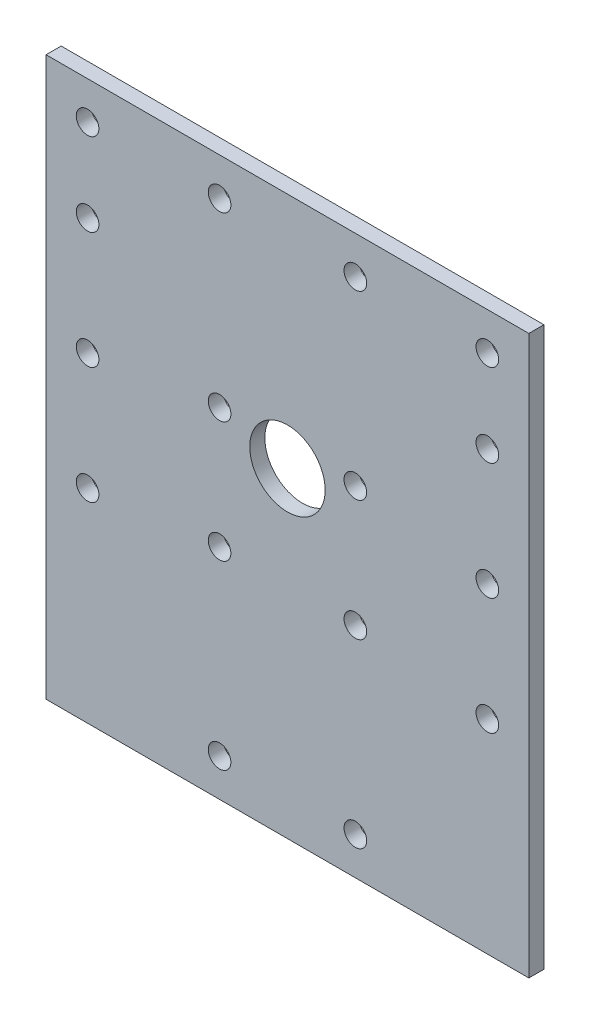
ISO-10303-21;
HEADER;
FILE_DESCRIPTION(('STEP AP214'),'2;1');
FILE_NAME('part.step','',(''),(''),'','','');
FILE_SCHEMA(('AUTOMOTIVE_DESIGN { 1 0 10303 214 1 1 1 1 }'));
ENDSEC;
DATA;
#1=APPLICATION_CONTEXT('core data for automotive mechanical design processes');
#2=APPLICATION_PROTOCOL_DEFINITION('international standard','automotive_design',2000,#1);
#3=PRODUCT_CONTEXT('',#1,'mechanical');
#4=PRODUCT('Part','Part','',(#3));
#5=PRODUCT_RELATED_PRODUCT_CATEGORY('part','',(#4));
#6=PRODUCT_DEFINITION_FORMATION('','',#4);
#7=PRODUCT_DEFINITION_CONTEXT('part definition',#1,'design');
#8=PRODUCT_DEFINITION('design','',#6,#7);
#9=PRODUCT_DEFINITION_SHAPE('','',#8);
#10=(LENGTH_UNIT() NAMED_UNIT(*) SI_UNIT(.MILLI.,.METRE.));
#11=(NAMED_UNIT(*) PLANE_ANGLE_UNIT() SI_UNIT($,.RADIAN.));
#12=(NAMED_UNIT(*) SI_UNIT($,.STERADIAN.) SOLID_ANGLE_UNIT());
#13=UNCERTAINTY_MEASURE_WITH_UNIT(LENGTH_MEASURE(1.E-05),#10,'distance_accuracy_value','');
#14=(GEOMETRIC_REPRESENTATION_CONTEXT(3) GLOBAL_UNCERTAINTY_ASSIGNED_CONTEXT((#13)) GLOBAL_UNIT_ASSIGNED_CONTEXT((#10,
#11,#12)) REPRESENTATION_CONTEXT('',''));
#15=CARTESIAN_POINT('',(0.,0.,0.));
#16=DIRECTION('',(0.,0.,1.));
#17=DIRECTION('',(1.,0.,0.));
#18=AXIS2_PLACEMENT_3D('',#15,#16,#17);
#19=CARTESIAN_POINT('',(32.0005499171305,37.,2.));
#20=DIRECTION('',(0.,0.,-1.));
#21=DIRECTION('',(-1.,0.,0.));
#22=AXIS2_PLACEMENT_3D('',#19,#20,#21);
#23=PLANE('',#22);
#24=CARTESIAN_POINT('',(-26.5,21.,2.));
#25=DIRECTION('',(0.,0.,1.));
#26=DIRECTION('',(-1.,0.,0.));
#27=AXIS2_PLACEMENT_3D('',#24,#25,#26);
#28=CIRCLE('',#27,1.50000000000001);
#29=CARTESIAN_POINT('',(-28.,21.,2.));
#30=VERTEX_POINT('',#29);
#31=EDGE_CURVE('E196',#30,#30,#28,.T.);
#32=ORIENTED_EDGE('',*,*,#31,.F.);
#33=EDGE_LOOP('',(#32));
#34=FACE_BOUND('',#33,.T.);
#35=CARTESIAN_POINT('',(-26.5,-10.,2.));
#36=DIRECTION('',(0.,0.,1.));
#37=DIRECTION('',(-1.,0.,0.));
#38=AXIS2_PLACEMENT_3D('',#35,#36,#37);
#39=CIRCLE('',#38,1.50000000000001);
#40=CARTESIAN_POINT('',(-28.,-10.,2.));
#41=VERTEX_POINT('',#40);
#42=EDGE_CURVE('E184',#41,#41,#39,.T.);
#43=ORIENTED_EDGE('',*,*,#42,.F.);
#44=EDGE_LOOP('',(#43));
#45=FACE_BOUND('',#44,.T.);
#46=CARTESIAN_POINT('',(9.00000000000001,-32.,2.));
#47=DIRECTION('',(0.,0.,1.));
#48=DIRECTION('',(-1.,0.,0.));
#49=AXIS2_PLACEMENT_3D('',#46,#47,#48);
#50=CIRCLE('',#49,1.5);
#51=CARTESIAN_POINT('',(7.50000000000001,-32.,2.));
#52=VERTEX_POINT('',#51);
#53=EDGE_CURVE('E172',#52,#52,#50,.T.);
#54=ORIENTED_EDGE('',*,*,#53,.F.);
#55=EDGE_LOOP('',(#54));
#56=FACE_BOUND('',#55,.T.);
#57=CARTESIAN_POINT('',(9.,8.,2.));
#58=DIRECTION('',(0.,0.,1.));
#59=DIRECTION('',(-1.,0.,0.));
#60=AXIS2_PLACEMENT_3D('',#57,#58,#59);
#61=CIRCLE('',#60,1.5);
#62=CARTESIAN_POINT('',(7.5,8.,2.));
#63=VERTEX_POINT('',#62);
#64=EDGE_CURVE('E160',#63,#63,#61,.T.);
#65=ORIENTED_EDGE('',*,*,#64,.F.);
#66=EDGE_LOOP('',(#65));
#67=FACE_BOUND('',#66,.T.);
#68=CARTESIAN_POINT('',(26.5,32.,2.));
#69=DIRECTION('',(0.,0.,1.));
#70=DIRECTION('',(1.,0.,0.));
#71=AXIS2_PLACEMENT_3D('',#68,#69,#70);
#72=CIRCLE('',#71,1.50000000000001);
#73=CARTESIAN_POINT('',(28.,32.,2.));
#74=VERTEX_POINT('',#73);
#75=EDGE_CURVE('E148',#74,#74,#72,.T.);
#76=ORIENTED_EDGE('',*,*,#75,.F.);
#77=EDGE_LOOP('',(#76));
#78=FACE_BOUND('',#77,.T.);
#79=CARTESIAN_POINT('',(-9.,-8.,2.));
#80=DIRECTION('',(0.,0.,1.));
#81=DIRECTION('',(1.,0.,0.));
#82=AXIS2_PLACEMENT_3D('',#79,#80,#81);
#83=CIRCLE('',#82,1.5);
#84=CARTESIAN_POINT('',(-7.5,-8.,2.));
#85=VERTEX_POINT('',#84);
#86=EDGE_CURVE('E136',#85,#85,#83,.T.);
#87=ORIENTED_EDGE('',*,*,#86,.F.);
#88=EDGE_LOOP('',(#87));
#89=FACE_BOUND('',#88,.T.);
#90=CARTESIAN_POINT('',(-9.,8.,2.));
#91=DIRECTION('',(0.,0.,1.));
#92=DIRECTION('',(1.,0.,0.));
#93=AXIS2_PLACEMENT_3D('',#90,#91,#92);
#94=CIRCLE('',#93,1.5);
#95=CARTESIAN_POINT('',(-7.5,8.,2.));
#96=VERTEX_POINT('',#95);
#97=EDGE_CURVE('E124',#96,#96,#94,.T.);
#98=ORIENTED_EDGE('',*,*,#97,.F.);
#99=EDGE_LOOP('',(#98));
#100=FACE_BOUND('',#99,.T.);
#101=CARTESIAN_POINT('',(-9.,32.,2.));
#102=DIRECTION('',(0.,0.,1.));
#103=DIRECTION('',(1.,0.,0.));
#104=AXIS2_PLACEMENT_3D('',#101,#102,#103);
#105=CIRCLE('',#104,1.5);
#106=CARTESIAN_POINT('',(-7.5,32.,2.));
#107=VERTEX_POINT('',#106);
#108=EDGE_CURVE('E112',#107,#107,#105,.T.);
#109=ORIENTED_EDGE('',*,*,#108,.F.);
#110=EDGE_LOOP('',(#109));
#111=FACE_BOUND('',#110,.T.);
#112=DIRECTION('',(0.,1.,0.));
#113=VECTOR('',#112,1.);
#114=CARTESIAN_POINT('',(32.0005499171305,-37.,2.));
#115=LINE('',#114,#113);
#116=CARTESIAN_POINT('',(32.0005499171305,-37.,2.));
#117=VERTEX_POINT('',#116);
#118=CARTESIAN_POINT('',(32.0005499171305,37.,2.));
#119=VERTEX_POINT('',#118);
#120=EDGE_CURVE('E82',#117,#119,#115,.T.);
#121=ORIENTED_EDGE('',*,*,#120,.T.);
#122=DIRECTION('',(-1.,0.,0.));
#123=VECTOR('',#122,1.);
#124=CARTESIAN_POINT('',(-32.0005499171305,37.,2.));
#125=LINE('',#124,#123);
#126=CARTESIAN_POINT('',(-32.0005499171305,37.,2.));
#127=VERTEX_POINT('',#126);
#128=EDGE_CURVE('E77',#119,#127,#125,.T.);
#129=ORIENTED_EDGE('',*,*,#128,.T.);
#130=DIRECTION('',(0.,-1.,0.));
#131=VECTOR('',#130,1.);
#132=CARTESIAN_POINT('',(-32.0005499171305,-37.,2.));
#133=LINE('',#132,#131);
#134=CARTESIAN_POINT('',(-32.0005499171305,-37.,2.));
#135=VERTEX_POINT('',#134);
#136=EDGE_CURVE('E80',#127,#135,#133,.T.);
#137=ORIENTED_EDGE('',*,*,#136,.T.);
#138=DIRECTION('',(1.,0.,0.));
#139=VECTOR('',#138,1.);
#140=CARTESIAN_POINT('',(-32.0005499171305,-37.,2.));
#141=LINE('',#140,#139);
#142=EDGE_CURVE('E47',#135,#117,#141,.T.);
#143=ORIENTED_EDGE('',*,*,#142,.T.);
#144=EDGE_LOOP('',(#121,#129,#137,#143));
#145=FACE_BOUND('',#144,.T.);
#146=CARTESIAN_POINT('',(26.5,-10.,2.));
#147=DIRECTION('',(0.,0.,1.));
#148=DIRECTION('',(1.,0.,0.));
#149=AXIS2_PLACEMENT_3D('',#146,#147,#148);
#150=CIRCLE('',#149,1.50000000000001);
#151=CARTESIAN_POINT('',(28.,-10.,2.));
#152=VERTEX_POINT('',#151);
#153=EDGE_CURVE('E97',#152,#152,#150,.T.);
#154=ORIENTED_EDGE('',*,*,#153,.F.);
#155=EDGE_LOOP('',(#154));
#156=FACE_BOUND('',#155,.T.);
#157=CARTESIAN_POINT('',(26.5,5.50000000000001,2.));
#158=DIRECTION('',(0.,0.,1.));
#159=DIRECTION('',(1.,0.,0.));
#160=AXIS2_PLACEMENT_3D('',#157,#158,#159);
#161=CIRCLE('',#160,1.50000000000001);
#162=CARTESIAN_POINT('',(28.,5.50000000000001,2.));
#163=VERTEX_POINT('',#162);
#164=EDGE_CURVE('E118',#163,#163,#161,.T.);
#165=ORIENTED_EDGE('',*,*,#164,.F.);
#166=EDGE_LOOP('',(#165));
#167=FACE_BOUND('',#166,.T.);
#168=CARTESIAN_POINT('',(-9.,-32.,2.));
#169=DIRECTION('',(0.,0.,1.));
#170=DIRECTION('',(1.,0.,0.));
#171=AXIS2_PLACEMENT_3D('',#168,#169,#170);
#172=CIRCLE('',#171,1.5);
#173=CARTESIAN_POINT('',(-7.5,-32.,2.));
#174=VERTEX_POINT('',#173);
#175=EDGE_CURVE('E130',#174,#174,#172,.T.);
#176=ORIENTED_EDGE('',*,*,#175,.F.);
#177=EDGE_LOOP('',(#176));
#178=FACE_BOUND('',#177,.T.);
#179=CARTESIAN_POINT('',(26.5,21.,2.));
#180=DIRECTION('',(0.,0.,1.));
#181=DIRECTION('',(1.,0.,0.));
#182=AXIS2_PLACEMENT_3D('',#179,#180,#181);
#183=CIRCLE('',#182,1.50000000000001);
#184=CARTESIAN_POINT('',(28.,21.,2.));
#185=VERTEX_POINT('',#184);
#186=EDGE_CURVE('E142',#185,#185,#183,.T.);
#187=ORIENTED_EDGE('',*,*,#186,.F.);
#188=EDGE_LOOP('',(#187));
#189=FACE_BOUND('',#188,.T.);
#190=CARTESIAN_POINT('',(8.99999999999999,32.,2.));
#191=DIRECTION('',(0.,0.,1.));
#192=DIRECTION('',(-1.,0.,0.));
#193=AXIS2_PLACEMENT_3D('',#190,#191,#192);
#194=CIRCLE('',#193,1.5);
#195=CARTESIAN_POINT('',(7.49999999999999,32.,2.));
#196=VERTEX_POINT('',#195);
#197=EDGE_CURVE('E154',#196,#196,#194,.T.);
#198=ORIENTED_EDGE('',*,*,#197,.F.);
#199=EDGE_LOOP('',(#198));
#200=FACE_BOUND('',#199,.T.);
#201=CARTESIAN_POINT('',(9.00000000000001,-8.,2.));
#202=DIRECTION('',(0.,0.,1.));
#203=DIRECTION('',(-1.,0.,0.));
#204=AXIS2_PLACEMENT_3D('',#201,#202,#203);
#205=CIRCLE('',#204,1.5);
#206=CARTESIAN_POINT('',(7.50000000000001,-8.,2.));
#207=VERTEX_POINT('',#206);
#208=EDGE_CURVE('E166',#207,#207,#205,.T.);
#209=ORIENTED_EDGE('',*,*,#208,.F.);
#210=EDGE_LOOP('',(#209));
#211=FACE_BOUND('',#210,.T.);
#212=CARTESIAN_POINT('',(0.,5.5,2.));
#213=DIRECTION('',(0.,0.,1.));
#214=DIRECTION('',(1.,0.,0.));
#215=AXIS2_PLACEMENT_3D('',#212,#213,#214);
#216=CIRCLE('',#215,5.);
#217=CARTESIAN_POINT('',(5.,5.5,2.));
#218=VERTEX_POINT('',#217);
#219=EDGE_CURVE('E178',#218,#218,#216,.T.);
#220=ORIENTED_EDGE('',*,*,#219,.F.);
#221=EDGE_LOOP('',(#220));
#222=FACE_BOUND('',#221,.T.);
#223=CARTESIAN_POINT('',(-26.5,5.50000000000001,2.));
#224=DIRECTION('',(0.,0.,1.));
#225=DIRECTION('',(-1.,0.,0.));
#226=AXIS2_PLACEMENT_3D('',#223,#224,#225);
#227=CIRCLE('',#226,1.50000000000001);
#228=CARTESIAN_POINT('',(-28.,5.50000000000001,2.));
#229=VERTEX_POINT('',#228);
#230=EDGE_CURVE('E190',#229,#229,#227,.T.);
#231=ORIENTED_EDGE('',*,*,#230,.F.);
#232=EDGE_LOOP('',(#231));
#233=FACE_BOUND('',#232,.T.);
#234=CARTESIAN_POINT('',(-26.5,32.,2.));
#235=DIRECTION('',(0.,0.,1.));
#236=DIRECTION('',(-1.,0.,0.));
#237=AXIS2_PLACEMENT_3D('',#234,#235,#236);
#238=CIRCLE('',#237,1.50000000000001);
#239=CARTESIAN_POINT('',(-28.,32.,2.));
#240=VERTEX_POINT('',#239);
#241=EDGE_CURVE('E202',#240,#240,#238,.T.);
#242=ORIENTED_EDGE('',*,*,#241,.F.);
#243=EDGE_LOOP('',(#242));
#244=FACE_BOUND('',#243,.T.);
#245=ADVANCED_FACE('F30',(#34,#45,#56,#67,#78,#89,#100,#111,#145,#156,#167,#178,#189,#200,#211,
#222,#233,#244),#23,.F.);
#246=CARTESIAN_POINT('',(32.0005499171305,37.,0.));
#247=DIRECTION('',(0.,0.,-1.));
#248=DIRECTION('',(-1.,0.,0.));
#249=AXIS2_PLACEMENT_3D('',#246,#247,#248);
#250=PLANE('',#249);
#251=CARTESIAN_POINT('',(-26.5,21.,0.));
#252=DIRECTION('',(0.,0.,1.));
#253=DIRECTION('',(-1.,0.,0.));
#254=AXIS2_PLACEMENT_3D('',#251,#252,#253);
#255=CIRCLE('',#254,1.50000000000001);
#256=CARTESIAN_POINT('',(-28.,21.,0.));
#257=VERTEX_POINT('',#256);
#258=EDGE_CURVE('E199',#257,#257,#255,.T.);
#259=ORIENTED_EDGE('',*,*,#258,.T.);
#260=EDGE_LOOP('',(#259));
#261=FACE_BOUND('',#260,.T.);
#262=CARTESIAN_POINT('',(-26.5,-10.,0.));
#263=DIRECTION('',(0.,0.,1.));
#264=DIRECTION('',(-1.,0.,0.));
#265=AXIS2_PLACEMENT_3D('',#262,#263,#264);
#266=CIRCLE('',#265,1.50000000000001);
#267=CARTESIAN_POINT('',(-28.,-10.,0.));
#268=VERTEX_POINT('',#267);
#269=EDGE_CURVE('E187',#268,#268,#266,.T.);
#270=ORIENTED_EDGE('',*,*,#269,.T.);
#271=EDGE_LOOP('',(#270));
#272=FACE_BOUND('',#271,.T.);
#273=CARTESIAN_POINT('',(9.00000000000001,-32.,0.));
#274=DIRECTION('',(0.,0.,1.));
#275=DIRECTION('',(-1.,0.,0.));
#276=AXIS2_PLACEMENT_3D('',#273,#274,#275);
#277=CIRCLE('',#276,1.5);
#278=CARTESIAN_POINT('',(7.50000000000001,-32.,0.));
#279=VERTEX_POINT('',#278);
#280=EDGE_CURVE('E175',#279,#279,#277,.T.);
#281=ORIENTED_EDGE('',*,*,#280,.T.);
#282=EDGE_LOOP('',(#281));
#283=FACE_BOUND('',#282,.T.);
#284=CARTESIAN_POINT('',(9.,8.,0.));
#285=DIRECTION('',(0.,0.,1.));
#286=DIRECTION('',(-1.,0.,0.));
#287=AXIS2_PLACEMENT_3D('',#284,#285,#286);
#288=CIRCLE('',#287,1.5);
#289=CARTESIAN_POINT('',(7.5,8.,0.));
#290=VERTEX_POINT('',#289);
#291=EDGE_CURVE('E163',#290,#290,#288,.T.);
#292=ORIENTED_EDGE('',*,*,#291,.T.);
#293=EDGE_LOOP('',(#292));
#294=FACE_BOUND('',#293,.T.);
#295=CARTESIAN_POINT('',(26.5,32.,0.));
#296=DIRECTION('',(0.,0.,1.));
#297=DIRECTION('',(1.,0.,0.));
#298=AXIS2_PLACEMENT_3D('',#295,#296,#297);
#299=CIRCLE('',#298,1.50000000000001);
#300=CARTESIAN_POINT('',(28.,32.,0.));
#301=VERTEX_POINT('',#300);
#302=EDGE_CURVE('E151',#301,#301,#299,.T.);
#303=ORIENTED_EDGE('',*,*,#302,.T.);
#304=EDGE_LOOP('',(#303));
#305=FACE_BOUND('',#304,.T.);
#306=CARTESIAN_POINT('',(-9.,-8.,0.));
#307=DIRECTION('',(0.,0.,1.));
#308=DIRECTION('',(1.,0.,0.));
#309=AXIS2_PLACEMENT_3D('',#306,#307,#308);
#310=CIRCLE('',#309,1.5);
#311=CARTESIAN_POINT('',(-7.5,-8.,0.));
#312=VERTEX_POINT('',#311);
#313=EDGE_CURVE('E139',#312,#312,#310,.T.);
#314=ORIENTED_EDGE('',*,*,#313,.T.);
#315=EDGE_LOOP('',(#314));
#316=FACE_BOUND('',#315,.T.);
#317=CARTESIAN_POINT('',(-9.,8.,0.));
#318=DIRECTION('',(0.,0.,1.));
#319=DIRECTION('',(1.,0.,0.));
#320=AXIS2_PLACEMENT_3D('',#317,#318,#319);
#321=CIRCLE('',#320,1.5);
#322=CARTESIAN_POINT('',(-7.5,8.,0.));
#323=VERTEX_POINT('',#322);
#324=EDGE_CURVE('E127',#323,#323,#321,.T.);
#325=ORIENTED_EDGE('',*,*,#324,.T.);
#326=EDGE_LOOP('',(#325));
#327=FACE_BOUND('',#326,.T.);
#328=CARTESIAN_POINT('',(-9.,32.,0.));
#329=DIRECTION('',(0.,0.,1.));
#330=DIRECTION('',(1.,0.,0.));
#331=AXIS2_PLACEMENT_3D('',#328,#329,#330);
#332=CIRCLE('',#331,1.5);
#333=CARTESIAN_POINT('',(-7.5,32.,0.));
#334=VERTEX_POINT('',#333);
#335=EDGE_CURVE('E115',#334,#334,#332,.T.);
#336=ORIENTED_EDGE('',*,*,#335,.T.);
#337=EDGE_LOOP('',(#336));
#338=FACE_BOUND('',#337,.T.);
#339=DIRECTION('',(0.,1.,0.));
#340=VECTOR('',#339,1.);
#341=CARTESIAN_POINT('',(32.0005499171305,-37.,0.));
#342=LINE('',#341,#340);
#343=CARTESIAN_POINT('',(32.0005499171305,-37.,0.));
#344=VERTEX_POINT('',#343);
#345=CARTESIAN_POINT('',(32.0005499171305,37.,0.));
#346=VERTEX_POINT('',#345);
#347=EDGE_CURVE('E94',#344,#346,#342,.T.);
#348=ORIENTED_EDGE('',*,*,#347,.F.);
#349=DIRECTION('',(1.,0.,0.));
#350=VECTOR('',#349,1.);
#351=CARTESIAN_POINT('',(-32.0005499171305,-37.,0.));
#352=LINE('',#351,#350);
#353=CARTESIAN_POINT('',(-32.0005499171305,-37.,0.));
#354=VERTEX_POINT('',#353);
#355=EDGE_CURVE('E70',#354,#344,#352,.T.);
#356=ORIENTED_EDGE('',*,*,#355,.F.);
#357=DIRECTION('',(0.,-1.,0.));
#358=VECTOR('',#357,1.);
#359=CARTESIAN_POINT('',(-32.0005499171305,-37.,0.));
#360=LINE('',#359,#358);
#361=CARTESIAN_POINT('',(-32.0005499171305,37.,0.));
#362=VERTEX_POINT('',#361);
#363=EDGE_CURVE('E64',#362,#354,#360,.T.);
#364=ORIENTED_EDGE('',*,*,#363,.F.);
#365=DIRECTION('',(-1.,0.,0.));
#366=VECTOR('',#365,1.);
#367=CARTESIAN_POINT('',(-32.0005499171305,37.,0.));
#368=LINE('',#367,#366);
#369=EDGE_CURVE('E86',#346,#362,#368,.T.);
#370=ORIENTED_EDGE('',*,*,#369,.F.);
#371=EDGE_LOOP('',(#348,#356,#364,#370));
#372=FACE_BOUND('',#371,.T.);
#373=CARTESIAN_POINT('',(26.5,-10.,0.));
#374=DIRECTION('',(0.,0.,1.));
#375=DIRECTION('',(1.,0.,0.));
#376=AXIS2_PLACEMENT_3D('',#373,#374,#375);
#377=CIRCLE('',#376,1.50000000000001);
#378=CARTESIAN_POINT('',(28.,-10.,0.));
#379=VERTEX_POINT('',#378);
#380=EDGE_CURVE('E109',#379,#379,#377,.T.);
#381=ORIENTED_EDGE('',*,*,#380,.T.);
#382=EDGE_LOOP('',(#381));
#383=FACE_BOUND('',#382,.T.);
#384=CARTESIAN_POINT('',(26.5,5.50000000000001,0.));
#385=DIRECTION('',(0.,0.,1.));
#386=DIRECTION('',(1.,0.,0.));
#387=AXIS2_PLACEMENT_3D('',#384,#385,#386);
#388=CIRCLE('',#387,1.50000000000001);
#389=CARTESIAN_POINT('',(28.,5.50000000000001,0.));
#390=VERTEX_POINT('',#389);
#391=EDGE_CURVE('E121',#390,#390,#388,.T.);
#392=ORIENTED_EDGE('',*,*,#391,.T.);
#393=EDGE_LOOP('',(#392));
#394=FACE_BOUND('',#393,.T.);
#395=CARTESIAN_POINT('',(-9.,-32.,0.));
#396=DIRECTION('',(0.,0.,1.));
#397=DIRECTION('',(1.,0.,0.));
#398=AXIS2_PLACEMENT_3D('',#395,#396,#397);
#399=CIRCLE('',#398,1.5);
#400=CARTESIAN_POINT('',(-7.5,-32.,0.));
#401=VERTEX_POINT('',#400);
#402=EDGE_CURVE('E133',#401,#401,#399,.T.);
#403=ORIENTED_EDGE('',*,*,#402,.T.);
#404=EDGE_LOOP('',(#403));
#405=FACE_BOUND('',#404,.T.);
#406=CARTESIAN_POINT('',(26.5,21.,0.));
#407=DIRECTION('',(0.,0.,1.));
#408=DIRECTION('',(1.,0.,0.));
#409=AXIS2_PLACEMENT_3D('',#406,#407,#408);
#410=CIRCLE('',#409,1.50000000000001);
#411=CARTESIAN_POINT('',(28.,21.,0.));
#412=VERTEX_POINT('',#411);
#413=EDGE_CURVE('E145',#412,#412,#410,.T.);
#414=ORIENTED_EDGE('',*,*,#413,.T.);
#415=EDGE_LOOP('',(#414));
#416=FACE_BOUND('',#415,.T.);
#417=CARTESIAN_POINT('',(8.99999999999999,32.,0.));
#418=DIRECTION('',(0.,0.,1.));
#419=DIRECTION('',(-1.,0.,0.));
#420=AXIS2_PLACEMENT_3D('',#417,#418,#419);
#421=CIRCLE('',#420,1.5);
#422=CARTESIAN_POINT('',(7.49999999999999,32.,0.));
#423=VERTEX_POINT('',#422);
#424=EDGE_CURVE('E157',#423,#423,#421,.T.);
#425=ORIENTED_EDGE('',*,*,#424,.T.);
#426=EDGE_LOOP('',(#425));
#427=FACE_BOUND('',#426,.T.);
#428=CARTESIAN_POINT('',(9.00000000000001,-8.,0.));
#429=DIRECTION('',(0.,0.,1.));
#430=DIRECTION('',(-1.,0.,0.));
#431=AXIS2_PLACEMENT_3D('',#428,#429,#430);
#432=CIRCLE('',#431,1.5);
#433=CARTESIAN_POINT('',(7.50000000000001,-8.,0.));
#434=VERTEX_POINT('',#433);
#435=EDGE_CURVE('E169',#434,#434,#432,.T.);
#436=ORIENTED_EDGE('',*,*,#435,.T.);
#437=EDGE_LOOP('',(#436));
#438=FACE_BOUND('',#437,.T.);
#439=CARTESIAN_POINT('',(0.,5.5,0.));
#440=DIRECTION('',(0.,0.,1.));
#441=DIRECTION('',(1.,0.,0.));
#442=AXIS2_PLACEMENT_3D('',#439,#440,#441);
#443=CIRCLE('',#442,5.);
#444=CARTESIAN_POINT('',(5.,5.5,0.));
#445=VERTEX_POINT('',#444);
#446=EDGE_CURVE('E181',#445,#445,#443,.T.);
#447=ORIENTED_EDGE('',*,*,#446,.T.);
#448=EDGE_LOOP('',(#447));
#449=FACE_BOUND('',#448,.T.);
#450=CARTESIAN_POINT('',(-26.5,5.50000000000001,0.));
#451=DIRECTION('',(0.,0.,1.));
#452=DIRECTION('',(-1.,0.,0.));
#453=AXIS2_PLACEMENT_3D('',#450,#451,#452);
#454=CIRCLE('',#453,1.50000000000001);
#455=CARTESIAN_POINT('',(-28.,5.50000000000001,0.));
#456=VERTEX_POINT('',#455);
#457=EDGE_CURVE('E193',#456,#456,#454,.T.);
#458=ORIENTED_EDGE('',*,*,#457,.T.);
#459=EDGE_LOOP('',(#458));
#460=FACE_BOUND('',#459,.T.);
#461=CARTESIAN_POINT('',(-26.5,32.,0.));
#462=DIRECTION('',(0.,0.,1.));
#463=DIRECTION('',(-1.,0.,0.));
#464=AXIS2_PLACEMENT_3D('',#461,#462,#463);
#465=CIRCLE('',#464,1.50000000000001);
#466=CARTESIAN_POINT('',(-28.,32.,0.));
#467=VERTEX_POINT('',#466);
#468=EDGE_CURVE('E205',#467,#467,#465,.T.);
#469=ORIENTED_EDGE('',*,*,#468,.T.);
#470=EDGE_LOOP('',(#469));
#471=FACE_BOUND('',#470,.T.);
#472=ADVANCED_FACE('F105',(#261,#272,#283,#294,#305,#316,#327,#338,#372,#383,#394,#405,#416,
#427,#438,#449,#460,#471),#250,.T.);
#473=CARTESIAN_POINT('',(32.0005499171305,-37.,2.));
#474=DIRECTION('',(-1.,0.,0.));
#475=DIRECTION('',(0.,0.,1.));
#476=AXIS2_PLACEMENT_3D('',#473,#474,#475);
#477=PLANE('',#476);
#478=ORIENTED_EDGE('',*,*,#347,.T.);
#479=DIRECTION('',(0.,0.,-1.));
#480=VECTOR('',#479,1.);
#481=CARTESIAN_POINT('',(32.0005499171305,37.,2.));
#482=LINE('',#481,#480);
#483=EDGE_CURVE('E11',#119,#346,#482,.T.);
#484=ORIENTED_EDGE('',*,*,#483,.F.);
#485=ORIENTED_EDGE('',*,*,#120,.F.);
#486=DIRECTION('',(0.,0.,-1.));
#487=VECTOR('',#486,1.);
#488=CARTESIAN_POINT('',(32.0005499171305,-37.,2.));
#489=LINE('',#488,#487);
#490=EDGE_CURVE('E90',#117,#344,#489,.T.);
#491=ORIENTED_EDGE('',*,*,#490,.T.);
#492=EDGE_LOOP('',(#478,#484,#485,#491));
#493=FACE_BOUND('',#492,.T.);
#494=ADVANCED_FACE('F32',(#493),#477,.F.);
#495=CARTESIAN_POINT('',(-32.0005499171305,37.,2.));
#496=DIRECTION('',(0.,-1.,0.));
#497=DIRECTION('',(0.,0.,-1.));
#498=AXIS2_PLACEMENT_3D('',#495,#496,#497);
#499=PLANE('',#498);
#500=ORIENTED_EDGE('',*,*,#369,.T.);
#501=DIRECTION('',(0.,0.,-1.));
#502=VECTOR('',#501,1.);
#503=CARTESIAN_POINT('',(-32.0005499171305,37.,2.));
#504=LINE('',#503,#502);
#505=EDGE_CURVE('E39',#127,#362,#504,.T.);
#506=ORIENTED_EDGE('',*,*,#505,.F.);
#507=ORIENTED_EDGE('',*,*,#128,.F.);
#508=ORIENTED_EDGE('',*,*,#483,.T.);
#509=EDGE_LOOP('',(#500,#506,#507,#508));
#510=FACE_BOUND('',#509,.T.);
#511=ADVANCED_FACE('F85',(#510),#499,.F.);
#512=CARTESIAN_POINT('',(-32.0005499171305,-37.,2.));
#513=DIRECTION('',(1.,0.,0.));
#514=DIRECTION('',(0.,0.,-1.));
#515=AXIS2_PLACEMENT_3D('',#512,#513,#514);
#516=PLANE('',#515);
#517=ORIENTED_EDGE('',*,*,#363,.T.);
#518=DIRECTION('',(0.,0.,-1.));
#519=VECTOR('',#518,1.);
#520=CARTESIAN_POINT('',(-32.0005499171305,-37.,2.));
#521=LINE('',#520,#519);
#522=EDGE_CURVE('E87',#135,#354,#521,.T.);
#523=ORIENTED_EDGE('',*,*,#522,.F.);
#524=ORIENTED_EDGE('',*,*,#136,.F.);
#525=ORIENTED_EDGE('',*,*,#505,.T.);
#526=EDGE_LOOP('',(#517,#523,#524,#525));
#527=FACE_BOUND('',#526,.T.);
#528=ADVANCED_FACE('F88',(#527),#516,.F.);
#529=CARTESIAN_POINT('',(-32.0005499171305,-37.,2.));
#530=DIRECTION('',(0.,1.,0.));
#531=DIRECTION('',(0.,0.,1.));
#532=AXIS2_PLACEMENT_3D('',#529,#530,#531);
#533=PLANE('',#532);
#534=ORIENTED_EDGE('',*,*,#355,.T.);
#535=ORIENTED_EDGE('',*,*,#490,.F.);
#536=ORIENTED_EDGE('',*,*,#142,.F.);
#537=ORIENTED_EDGE('',*,*,#522,.T.);
#538=EDGE_LOOP('',(#534,#535,#536,#537));
#539=FACE_BOUND('',#538,.T.);
#540=ADVANCED_FACE('F102',(#539),#533,.F.);
#541=CARTESIAN_POINT('',(26.5,-10.,2.));
#542=DIRECTION('',(0.,0.,-1.));
#543=DIRECTION('',(-1.,0.,0.));
#544=AXIS2_PLACEMENT_3D('',#541,#542,#543);
#545=CYLINDRICAL_SURFACE('',#544,1.50000000000001);
#546=ORIENTED_EDGE('',*,*,#153,.T.);
#547=EDGE_LOOP('',(#546));
#548=FACE_BOUND('',#547,.T.);
#549=ORIENTED_EDGE('',*,*,#380,.F.);
#550=EDGE_LOOP('',(#549));
#551=FACE_BOUND('',#550,.T.);
#552=ADVANCED_FACE('F225',(#548,#551),#545,.F.);
#553=CARTESIAN_POINT('',(-9.,32.,2.));
#554=DIRECTION('',(0.,0.,-1.));
#555=DIRECTION('',(-1.,0.,0.));
#556=AXIS2_PLACEMENT_3D('',#553,#554,#555);
#557=CYLINDRICAL_SURFACE('',#556,1.5);
#558=ORIENTED_EDGE('',*,*,#108,.T.);
#559=EDGE_LOOP('',(#558));
#560=FACE_BOUND('',#559,.T.);
#561=ORIENTED_EDGE('',*,*,#335,.F.);
#562=EDGE_LOOP('',(#561));
#563=FACE_BOUND('',#562,.T.);
#564=ADVANCED_FACE('F271',(#560,#563),#557,.F.);
#565=CARTESIAN_POINT('',(26.5,5.50000000000001,2.));
#566=DIRECTION('',(0.,0.,-1.));
#567=DIRECTION('',(-1.,0.,0.));
#568=AXIS2_PLACEMENT_3D('',#565,#566,#567);
#569=CYLINDRICAL_SURFACE('',#568,1.50000000000001);
#570=ORIENTED_EDGE('',*,*,#164,.T.);
#571=EDGE_LOOP('',(#570));
#572=FACE_BOUND('',#571,.T.);
#573=ORIENTED_EDGE('',*,*,#391,.F.);
#574=EDGE_LOOP('',(#573));
#575=FACE_BOUND('',#574,.T.);
#576=ADVANCED_FACE('F279',(#572,#575),#569,.F.);
#577=CARTESIAN_POINT('',(-9.,8.,2.));
#578=DIRECTION('',(0.,0.,-1.));
#579=DIRECTION('',(-1.,0.,0.));
#580=AXIS2_PLACEMENT_3D('',#577,#578,#579);
#581=CYLINDRICAL_SURFACE('',#580,1.5);
#582=ORIENTED_EDGE('',*,*,#97,.T.);
#583=EDGE_LOOP('',(#582));
#584=FACE_BOUND('',#583,.T.);
#585=ORIENTED_EDGE('',*,*,#324,.F.);
#586=EDGE_LOOP('',(#585));
#587=FACE_BOUND('',#586,.T.);
#588=ADVANCED_FACE('F287',(#584,#587),#581,.F.);
#589=CARTESIAN_POINT('',(-9.,-32.,2.));
#590=DIRECTION('',(0.,0.,-1.));
#591=DIRECTION('',(-1.,0.,0.));
#592=AXIS2_PLACEMENT_3D('',#589,#590,#591);
#593=CYLINDRICAL_SURFACE('',#592,1.5);
#594=ORIENTED_EDGE('',*,*,#175,.T.);
#595=EDGE_LOOP('',(#594));
#596=FACE_BOUND('',#595,.T.);
#597=ORIENTED_EDGE('',*,*,#402,.F.);
#598=EDGE_LOOP('',(#597));
#599=FACE_BOUND('',#598,.T.);
#600=ADVANCED_FACE('F296',(#596,#599),#593,.F.);
#601=CARTESIAN_POINT('',(-9.,-8.,2.));
#602=DIRECTION('',(0.,0.,-1.));
#603=DIRECTION('',(-1.,0.,0.));
#604=AXIS2_PLACEMENT_3D('',#601,#602,#603);
#605=CYLINDRICAL_SURFACE('',#604,1.5);
#606=ORIENTED_EDGE('',*,*,#86,.T.);
#607=EDGE_LOOP('',(#606));
#608=FACE_BOUND('',#607,.T.);
#609=ORIENTED_EDGE('',*,*,#313,.F.);
#610=EDGE_LOOP('',(#609));
#611=FACE_BOUND('',#610,.T.);
#612=ADVANCED_FACE('F305',(#608,#611),#605,.F.);
#613=CARTESIAN_POINT('',(26.5,21.,2.));
#614=DIRECTION('',(0.,0.,-1.));
#615=DIRECTION('',(-1.,0.,0.));
#616=AXIS2_PLACEMENT_3D('',#613,#614,#615);
#617=CYLINDRICAL_SURFACE('',#616,1.50000000000001);
#618=ORIENTED_EDGE('',*,*,#186,.T.);
#619=EDGE_LOOP('',(#618));
#620=FACE_BOUND('',#619,.T.);
#621=ORIENTED_EDGE('',*,*,#413,.F.);
#622=EDGE_LOOP('',(#621));
#623=FACE_BOUND('',#622,.T.);
#624=ADVANCED_FACE('F314',(#620,#623),#617,.F.);
#625=CARTESIAN_POINT('',(26.5,32.,2.));
#626=DIRECTION('',(0.,0.,-1.));
#627=DIRECTION('',(-1.,0.,0.));
#628=AXIS2_PLACEMENT_3D('',#625,#626,#627);
#629=CYLINDRICAL_SURFACE('',#628,1.50000000000001);
#630=ORIENTED_EDGE('',*,*,#75,.T.);
#631=EDGE_LOOP('',(#630));
#632=FACE_BOUND('',#631,.T.);
#633=ORIENTED_EDGE('',*,*,#302,.F.);
#634=EDGE_LOOP('',(#633));
#635=FACE_BOUND('',#634,.T.);
#636=ADVANCED_FACE('F323',(#632,#635),#629,.F.);
#637=CARTESIAN_POINT('',(8.99999999999999,32.,2.));
#638=DIRECTION('',(0.,0.,-1.));
#639=DIRECTION('',(-1.,0.,0.));
#640=AXIS2_PLACEMENT_3D('',#637,#638,#639);
#641=CYLINDRICAL_SURFACE('',#640,1.5);
#642=ORIENTED_EDGE('',*,*,#197,.T.);
#643=EDGE_LOOP('',(#642));
#644=FACE_BOUND('',#643,.T.);
#645=ORIENTED_EDGE('',*,*,#424,.F.);
#646=EDGE_LOOP('',(#645));
#647=FACE_BOUND('',#646,.T.);
#648=ADVANCED_FACE('F332',(#644,#647),#641,.F.);
#649=CARTESIAN_POINT('',(9.,8.,2.));
#650=DIRECTION('',(0.,0.,-1.));
#651=DIRECTION('',(-1.,0.,0.));
#652=AXIS2_PLACEMENT_3D('',#649,#650,#651);
#653=CYLINDRICAL_SURFACE('',#652,1.5);
#654=ORIENTED_EDGE('',*,*,#64,.T.);
#655=EDGE_LOOP('',(#654));
#656=FACE_BOUND('',#655,.T.);
#657=ORIENTED_EDGE('',*,*,#291,.F.);
#658=EDGE_LOOP('',(#657));
#659=FACE_BOUND('',#658,.T.);
#660=ADVANCED_FACE('F341',(#656,#659),#653,.F.);
#661=CARTESIAN_POINT('',(9.00000000000001,-8.,2.));
#662=DIRECTION('',(0.,0.,-1.));
#663=DIRECTION('',(-1.,0.,0.));
#664=AXIS2_PLACEMENT_3D('',#661,#662,#663);
#665=CYLINDRICAL_SURFACE('',#664,1.5);
#666=ORIENTED_EDGE('',*,*,#208,.T.);
#667=EDGE_LOOP('',(#666));
#668=FACE_BOUND('',#667,.T.);
#669=ORIENTED_EDGE('',*,*,#435,.F.);
#670=EDGE_LOOP('',(#669));
#671=FACE_BOUND('',#670,.T.);
#672=ADVANCED_FACE('F350',(#668,#671),#665,.F.);
#673=CARTESIAN_POINT('',(9.00000000000001,-32.,2.));
#674=DIRECTION('',(0.,0.,-1.));
#675=DIRECTION('',(-1.,0.,0.));
#676=AXIS2_PLACEMENT_3D('',#673,#674,#675);
#677=CYLINDRICAL_SURFACE('',#676,1.5);
#678=ORIENTED_EDGE('',*,*,#53,.T.);
#679=EDGE_LOOP('',(#678));
#680=FACE_BOUND('',#679,.T.);
#681=ORIENTED_EDGE('',*,*,#280,.F.);
#682=EDGE_LOOP('',(#681));
#683=FACE_BOUND('',#682,.T.);
#684=ADVANCED_FACE('F359',(#680,#683),#677,.F.);
#685=CARTESIAN_POINT('',(0.,5.5,2.));
#686=DIRECTION('',(0.,0.,-1.));
#687=DIRECTION('',(-1.,0.,0.));
#688=AXIS2_PLACEMENT_3D('',#685,#686,#687);
#689=CYLINDRICAL_SURFACE('',#688,5.);
#690=ORIENTED_EDGE('',*,*,#219,.T.);
#691=EDGE_LOOP('',(#690));
#692=FACE_BOUND('',#691,.T.);
#693=ORIENTED_EDGE('',*,*,#446,.F.);
#694=EDGE_LOOP('',(#693));
#695=FACE_BOUND('',#694,.T.);
#696=ADVANCED_FACE('F368',(#692,#695),#689,.F.);
#697=CARTESIAN_POINT('',(-26.5,-10.,2.));
#698=DIRECTION('',(0.,0.,-1.));
#699=DIRECTION('',(-1.,0.,0.));
#700=AXIS2_PLACEMENT_3D('',#697,#698,#699);
#701=CYLINDRICAL_SURFACE('',#700,1.50000000000001);
#702=ORIENTED_EDGE('',*,*,#42,.T.);
#703=EDGE_LOOP('',(#702));
#704=FACE_BOUND('',#703,.T.);
#705=ORIENTED_EDGE('',*,*,#269,.F.);
#706=EDGE_LOOP('',(#705));
#707=FACE_BOUND('',#706,.T.);
#708=ADVANCED_FACE('F377',(#704,#707),#701,.F.);
#709=CARTESIAN_POINT('',(-26.5,5.50000000000001,2.));
#710=DIRECTION('',(0.,0.,-1.));
#711=DIRECTION('',(-1.,0.,0.));
#712=AXIS2_PLACEMENT_3D('',#709,#710,#711);
#713=CYLINDRICAL_SURFACE('',#712,1.50000000000001);
#714=ORIENTED_EDGE('',*,*,#230,.T.);
#715=EDGE_LOOP('',(#714));
#716=FACE_BOUND('',#715,.T.);
#717=ORIENTED_EDGE('',*,*,#457,.F.);
#718=EDGE_LOOP('',(#717));
#719=FACE_BOUND('',#718,.T.);
#720=ADVANCED_FACE('F386',(#716,#719),#713,.F.);
#721=CARTESIAN_POINT('',(-26.5,21.,2.));
#722=DIRECTION('',(0.,0.,-1.));
#723=DIRECTION('',(-1.,0.,0.));
#724=AXIS2_PLACEMENT_3D('',#721,#722,#723);
#725=CYLINDRICAL_SURFACE('',#724,1.50000000000001);
#726=ORIENTED_EDGE('',*,*,#31,.T.);
#727=EDGE_LOOP('',(#726));
#728=FACE_BOUND('',#727,.T.);
#729=ORIENTED_EDGE('',*,*,#258,.F.);
#730=EDGE_LOOP('',(#729));
#731=FACE_BOUND('',#730,.T.);
#732=ADVANCED_FACE('F395',(#728,#731),#725,.F.);
#733=CARTESIAN_POINT('',(-26.5,32.,2.));
#734=DIRECTION('',(0.,0.,-1.));
#735=DIRECTION('',(-1.,0.,0.));
#736=AXIS2_PLACEMENT_3D('',#733,#734,#735);
#737=CYLINDRICAL_SURFACE('',#736,1.50000000000001);
#738=ORIENTED_EDGE('',*,*,#241,.T.);
#739=EDGE_LOOP('',(#738));
#740=FACE_BOUND('',#739,.T.);
#741=ORIENTED_EDGE('',*,*,#468,.F.);
#742=EDGE_LOOP('',(#741));
#743=FACE_BOUND('',#742,.T.);
#744=ADVANCED_FACE('F211',(#740,#743),#737,.F.);
#745=CLOSED_SHELL('',(#245,#472,#494,#511,#528,#540,#552,#564,#576,#588,#600,#612,#624,#636,
#648,#660,#672,#684,#696,#708,#720,#732,#744));
#746=MANIFOLD_SOLID_BREP('B2',#745);
#747=ADVANCED_BREP_SHAPE_REPRESENTATION('',(#18,#746),#14);
#748=SHAPE_DEFINITION_REPRESENTATION(#9,#747);
ENDSEC;
END-ISO-10303-21;
